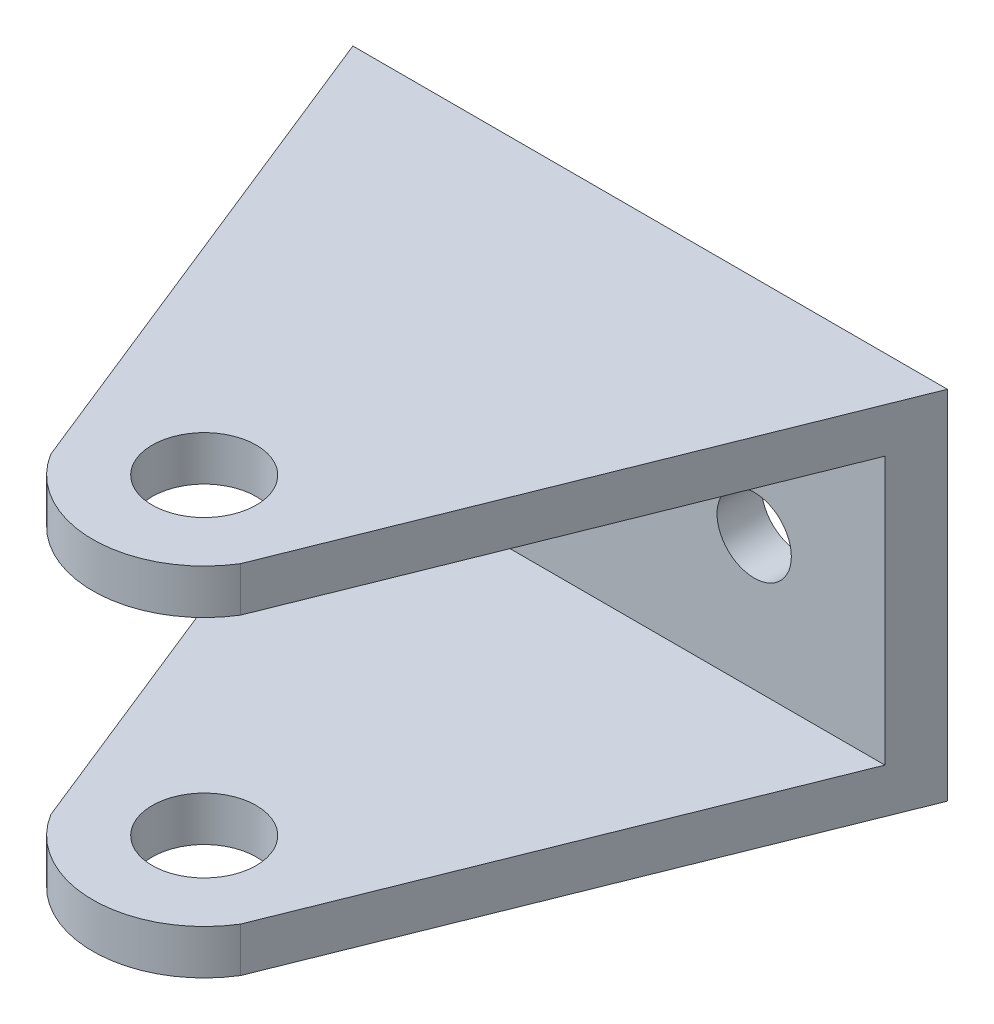
ISO-10303-21;
HEADER;
FILE_DESCRIPTION(('STEP AP214'),'2;1');
FILE_NAME('part.step','',(''),(''),'','','');
FILE_SCHEMA(('AUTOMOTIVE_DESIGN { 1 0 10303 214 1 1 1 1 }'));
ENDSEC;
DATA;
#1=APPLICATION_CONTEXT('core data for automotive mechanical design processes');
#2=APPLICATION_PROTOCOL_DEFINITION('international standard','automotive_design',2000,#1);
#3=PRODUCT_CONTEXT('',#1,'mechanical');
#4=PRODUCT('Part','Part','',(#3));
#5=PRODUCT_RELATED_PRODUCT_CATEGORY('part','',(#4));
#6=PRODUCT_DEFINITION_FORMATION('','',#4);
#7=PRODUCT_DEFINITION_CONTEXT('part definition',#1,'design');
#8=PRODUCT_DEFINITION('design','',#6,#7);
#9=PRODUCT_DEFINITION_SHAPE('','',#8);
#10=(LENGTH_UNIT() NAMED_UNIT(*) SI_UNIT(.MILLI.,.METRE.));
#11=(NAMED_UNIT(*) PLANE_ANGLE_UNIT() SI_UNIT($,.RADIAN.));
#12=(NAMED_UNIT(*) SI_UNIT($,.STERADIAN.) SOLID_ANGLE_UNIT());
#13=UNCERTAINTY_MEASURE_WITH_UNIT(LENGTH_MEASURE(1.E-05),#10,'distance_accuracy_value','');
#14=(GEOMETRIC_REPRESENTATION_CONTEXT(3) GLOBAL_UNCERTAINTY_ASSIGNED_CONTEXT((#13)) GLOBAL_UNIT_ASSIGNED_CONTEXT((#10,
#11,#12)) REPRESENTATION_CONTEXT('',''));
#15=CARTESIAN_POINT('',(0.,0.,0.));
#16=DIRECTION('',(0.,0.,1.));
#17=DIRECTION('',(1.,0.,0.));
#18=AXIS2_PLACEMENT_3D('',#15,#16,#17);
#19=CARTESIAN_POINT('',(0.,0.,3.));
#20=DIRECTION('',(0.,0.,1.));
#21=DIRECTION('',(1.,0.,0.));
#22=AXIS2_PLACEMENT_3D('',#19,#20,#21);
#23=PLANE('',#22);
#24=DIRECTION('',(0.,-1.,0.));
#25=VECTOR('',#24,1.);
#26=CARTESIAN_POINT('',(9.02360991477978,0.,3.));
#27=LINE('',#26,#25);
#28=CARTESIAN_POINT('',(9.02360991477978,13.3946482220998,3.));
#29=VERTEX_POINT('',#28);
#30=CARTESIAN_POINT('',(9.02360991477978,-4.60535177790018,3.));
#31=VERTEX_POINT('',#30);
#32=EDGE_CURVE('E166',#29,#31,#27,.T.);
#33=ORIENTED_EDGE('',*,*,#32,.F.);
#34=DIRECTION('',(1.,0.,0.));
#35=VECTOR('',#34,1.);
#36=CARTESIAN_POINT('',(-29.7726811713333,13.3946482220998,3.));
#37=LINE('',#36,#35);
#38=CARTESIAN_POINT('',(-28.5689722574463,13.3946482220998,3.));
#39=VERTEX_POINT('',#38);
#40=EDGE_CURVE('E178',#39,#29,#37,.T.);
#41=ORIENTED_EDGE('',*,*,#40,.F.);
#42=DIRECTION('',(0.,1.,0.));
#43=VECTOR('',#42,1.);
#44=CARTESIAN_POINT('',(-28.5689722574463,0.,3.));
#45=LINE('',#44,#43);
#46=CARTESIAN_POINT('',(-28.5689722574463,-4.60535177790018,3.));
#47=VERTEX_POINT('',#46);
#48=EDGE_CURVE('E51',#47,#39,#45,.T.);
#49=ORIENTED_EDGE('',*,*,#48,.F.);
#50=DIRECTION('',(-1.,0.,0.));
#51=VECTOR('',#50,1.);
#52=CARTESIAN_POINT('',(-29.7726811713333,-4.60535177790018,3.));
#53=LINE('',#52,#51);
#54=EDGE_CURVE('E180',#31,#47,#53,.T.);
#55=ORIENTED_EDGE('',*,*,#54,.F.);
#56=EDGE_LOOP('',(#33,#41,#49,#55));
#57=FACE_BOUND('',#56,.T.);
#58=CARTESIAN_POINT('',(-19.7726811713333,4.39464822209982,3.));
#59=DIRECTION('',(0.,0.,1.));
#60=DIRECTION('',(1.,0.,0.));
#61=AXIS2_PLACEMENT_3D('',#58,#59,#60);
#62=CIRCLE('',#61,2.5);
#63=CARTESIAN_POINT('',(-17.2726811713333,4.39464822209982,3.));
#64=VERTEX_POINT('',#63);
#65=EDGE_CURVE('E190',#64,#64,#62,.T.);
#66=ORIENTED_EDGE('',*,*,#65,.F.);
#67=EDGE_LOOP('',(#66));
#68=FACE_BOUND('',#67,.T.);
#69=CARTESIAN_POINT('',(0.227318828666726,4.39464822209982,3.));
#70=DIRECTION('',(0.,0.,1.));
#71=DIRECTION('',(1.,0.,0.));
#72=AXIS2_PLACEMENT_3D('',#69,#70,#71);
#73=CIRCLE('',#72,2.5);
#74=CARTESIAN_POINT('',(2.72731882866673,4.39464822209982,3.));
#75=VERTEX_POINT('',#74);
#76=EDGE_CURVE('E184',#75,#75,#73,.T.);
#77=ORIENTED_EDGE('',*,*,#76,.F.);
#78=EDGE_LOOP('',(#77));
#79=FACE_BOUND('',#78,.T.);
#80=ADVANCED_FACE('F35',(#57,#68,#79),#23,.T.);
#81=CARTESIAN_POINT('',(0.,0.,0.));
#82=DIRECTION('',(0.,0.,1.));
#83=DIRECTION('',(1.,0.,0.));
#84=AXIS2_PLACEMENT_3D('',#81,#82,#83);
#85=PLANE('',#84);
#86=DIRECTION('',(-1.,0.,0.));
#87=VECTOR('',#86,1.);
#88=CARTESIAN_POINT('',(-29.7726811713333,16.3946482220998,0.));
#89=LINE('',#88,#87);
#90=CARTESIAN_POINT('',(10.2273188286667,16.3946482220998,0.));
#91=VERTEX_POINT('',#90);
#92=CARTESIAN_POINT('',(-29.7726811713333,16.3946482220998,0.));
#93=VERTEX_POINT('',#92);
#94=EDGE_CURVE('E114',#91,#93,#89,.T.);
#95=ORIENTED_EDGE('',*,*,#94,.F.);
#96=DIRECTION('',(0.,1.,0.));
#97=VECTOR('',#96,1.);
#98=CARTESIAN_POINT('',(10.2273188286667,-7.60535177790018,0.));
#99=LINE('',#98,#97);
#100=CARTESIAN_POINT('',(10.2273188286667,-7.60535177790018,0.));
#101=VERTEX_POINT('',#100);
#102=EDGE_CURVE('E125',#101,#91,#99,.T.);
#103=ORIENTED_EDGE('',*,*,#102,.F.);
#104=DIRECTION('',(1.,0.,0.));
#105=VECTOR('',#104,1.);
#106=CARTESIAN_POINT('',(0.227318828666723,-7.60535177790018,0.));
#107=LINE('',#106,#105);
#108=CARTESIAN_POINT('',(-29.7726811713333,-7.60535177790018,0.));
#109=VERTEX_POINT('',#108);
#110=EDGE_CURVE('E113',#109,#101,#107,.T.);
#111=ORIENTED_EDGE('',*,*,#110,.F.);
#112=DIRECTION('',(0.,-1.,0.));
#113=VECTOR('',#112,1.);
#114=CARTESIAN_POINT('',(-29.7726811713333,16.3946482220998,0.));
#115=LINE('',#114,#113);
#116=EDGE_CURVE('E100',#93,#109,#115,.T.);
#117=ORIENTED_EDGE('',*,*,#116,.F.);
#118=EDGE_LOOP('',(#95,#103,#111,#117));
#119=FACE_BOUND('',#118,.T.);
#120=CARTESIAN_POINT('',(-19.7726811713333,4.39464822209982,0.));
#121=DIRECTION('',(0.,0.,1.));
#122=DIRECTION('',(1.,0.,0.));
#123=AXIS2_PLACEMENT_3D('',#120,#121,#122);
#124=CIRCLE('',#123,2.5);
#125=CARTESIAN_POINT('',(-17.2726811713333,4.39464822209982,0.));
#126=VERTEX_POINT('',#125);
#127=EDGE_CURVE('E187',#126,#126,#124,.T.);
#128=ORIENTED_EDGE('',*,*,#127,.T.);
#129=EDGE_LOOP('',(#128));
#130=FACE_BOUND('',#129,.T.);
#131=CARTESIAN_POINT('',(0.227318828666726,4.39464822209982,0.));
#132=DIRECTION('',(0.,0.,1.));
#133=DIRECTION('',(1.,0.,0.));
#134=AXIS2_PLACEMENT_3D('',#131,#132,#133);
#135=CIRCLE('',#134,2.5);
#136=CARTESIAN_POINT('',(2.72731882866673,4.39464822209982,0.));
#137=VERTEX_POINT('',#136);
#138=EDGE_CURVE('E183',#137,#137,#135,.T.);
#139=ORIENTED_EDGE('',*,*,#138,.T.);
#140=EDGE_LOOP('',(#139));
#141=FACE_BOUND('',#140,.T.);
#142=ADVANCED_FACE('F123',(#119,#130,#141),#85,.F.);
#143=CARTESIAN_POINT('',(-29.7726811713333,16.3946482220998,3.));
#144=DIRECTION('',(0.,-1.,0.));
#145=DIRECTION('',(0.,0.,-1.));
#146=AXIS2_PLACEMENT_3D('',#143,#144,#145);
#147=PLANE('',#146);
#148=CARTESIAN_POINT('',(-9.77268117133328,16.3946482220998,30.));
#149=DIRECTION('',(0.,-1.,0.));
#150=DIRECTION('',(0.,0.,-1.));
#151=AXIS2_PLACEMENT_3D('',#148,#149,#150);
#152=CIRCLE('',#151,3.5);
#153=CARTESIAN_POINT('',(-9.77268117133328,16.3946482220998,26.5));
#154=VERTEX_POINT('',#153);
#155=EDGE_CURVE('E175',#154,#154,#152,.T.);
#156=ORIENTED_EDGE('',*,*,#155,.T.);
#157=EDGE_LOOP('',(#156));
#158=FACE_BOUND('',#157,.T.);
#159=CARTESIAN_POINT('',(-9.77268117133328,16.3946482220998,30.));
#160=DIRECTION('',(0.,-1.,0.));
#161=DIRECTION('',(0.,0.,-1.));
#162=AXIS2_PLACEMENT_3D('',#159,#160,#161);
#163=CIRCLE('',#162,7.5);
#164=CARTESIAN_POINT('',(-16.155307847501,16.3946482220998,33.9385373824139));
#165=VERTEX_POINT('',#164);
#166=CARTESIAN_POINT('',(-3.39005449516551,16.3946482220998,33.9385373824139));
#167=VERTEX_POINT('',#166);
#168=EDGE_CURVE('E164',#165,#167,#163,.F.);
#169=ORIENTED_EDGE('',*,*,#168,.T.);
#170=DIRECTION('',(0.372379595116621,0.,-0.928080512208279));
#171=VECTOR('',#170,1.);
#172=CARTESIAN_POINT('',(3.64386157818276,16.3946482220998,16.4079301262921));
#173=LINE('',#172,#171);
#174=EDGE_CURVE('E148',#167,#91,#173,.T.);
#175=ORIENTED_EDGE('',*,*,#174,.T.);
#176=ORIENTED_EDGE('',*,*,#94,.T.);
#177=DIRECTION('',(0.372379595116621,0.,0.928080512208279));
#178=VECTOR('',#177,1.);
#179=CARTESIAN_POINT('',(-28.735886435218,16.3946482220998,2.58400031142234));
#180=LINE('',#179,#178);
#181=EDGE_CURVE('E108',#93,#165,#180,.T.);
#182=ORIENTED_EDGE('',*,*,#181,.T.);
#183=EDGE_LOOP('',(#169,#175,#176,#182));
#184=FACE_BOUND('',#183,.T.);
#185=ADVANCED_FACE('F37',(#158,#184),#147,.F.);
#186=CARTESIAN_POINT('',(0.227318828666723,-7.60535177790018,3.));
#187=DIRECTION('',(0.,1.,0.));
#188=DIRECTION('',(0.,0.,1.));
#189=AXIS2_PLACEMENT_3D('',#186,#187,#188);
#190=PLANE('',#189);
#191=CARTESIAN_POINT('',(-9.77268117133328,-7.60535177790018,30.));
#192=DIRECTION('',(0.,-1.,0.));
#193=DIRECTION('',(0.,0.,-1.));
#194=AXIS2_PLACEMENT_3D('',#191,#192,#193);
#195=CIRCLE('',#194,3.5);
#196=CARTESIAN_POINT('',(-9.77268117133328,-7.60535177790018,26.5));
#197=VERTEX_POINT('',#196);
#198=EDGE_CURVE('E121',#197,#197,#195,.T.);
#199=ORIENTED_EDGE('',*,*,#198,.F.);
#200=EDGE_LOOP('',(#199));
#201=FACE_BOUND('',#200,.T.);
#202=ORIENTED_EDGE('',*,*,#110,.T.);
#203=DIRECTION('',(0.372379595116621,0.,-0.928080512208279));
#204=VECTOR('',#203,1.);
#205=CARTESIAN_POINT('',(10.2273188286667,-7.60535177790018,0.));
#206=LINE('',#205,#204);
#207=CARTESIAN_POINT('',(-3.39005449516551,-7.60535177790018,33.9385373824139));
#208=VERTEX_POINT('',#207);
#209=EDGE_CURVE('E59',#208,#101,#206,.T.);
#210=ORIENTED_EDGE('',*,*,#209,.F.);
#211=CARTESIAN_POINT('',(-9.77268117133328,-7.60535177790018,30.));
#212=DIRECTION('',(0.,1.,0.));
#213=DIRECTION('',(0.,0.,-1.));
#214=AXIS2_PLACEMENT_3D('',#211,#212,#213);
#215=CIRCLE('',#214,7.5);
#216=CARTESIAN_POINT('',(-16.155307847501,-7.60535177790018,33.9385373824139));
#217=VERTEX_POINT('',#216);
#218=EDGE_CURVE('E120',#217,#208,#215,.T.);
#219=ORIENTED_EDGE('',*,*,#218,.F.);
#220=DIRECTION('',(0.372379595116621,0.,0.928080512208279));
#221=VECTOR('',#220,1.);
#222=CARTESIAN_POINT('',(-29.7726811713333,-7.60535177790018,0.));
#223=LINE('',#222,#221);
#224=EDGE_CURVE('E104',#109,#217,#223,.T.);
#225=ORIENTED_EDGE('',*,*,#224,.F.);
#226=EDGE_LOOP('',(#202,#210,#219,#225));
#227=FACE_BOUND('',#226,.T.);
#228=ADVANCED_FACE('F117',(#201,#227),#190,.F.);
#229=CARTESIAN_POINT('',(-19.7726811713333,4.39464822209982,3.));
#230=DIRECTION('',(0.,0.,-1.));
#231=DIRECTION('',(-1.,0.,0.));
#232=AXIS2_PLACEMENT_3D('',#229,#230,#231);
#233=CYLINDRICAL_SURFACE('',#232,2.5);
#234=ORIENTED_EDGE('',*,*,#65,.T.);
#235=EDGE_LOOP('',(#234));
#236=FACE_BOUND('',#235,.T.);
#237=ORIENTED_EDGE('',*,*,#127,.F.);
#238=EDGE_LOOP('',(#237));
#239=FACE_BOUND('',#238,.T.);
#240=ADVANCED_FACE('F201',(#236,#239),#233,.F.);
#241=CARTESIAN_POINT('',(0.227318828666726,4.39464822209982,3.));
#242=DIRECTION('',(0.,0.,-1.));
#243=DIRECTION('',(-1.,0.,0.));
#244=AXIS2_PLACEMENT_3D('',#241,#242,#243);
#245=CYLINDRICAL_SURFACE('',#244,2.5);
#246=ORIENTED_EDGE('',*,*,#76,.T.);
#247=EDGE_LOOP('',(#246));
#248=FACE_BOUND('',#247,.T.);
#249=ORIENTED_EDGE('',*,*,#138,.F.);
#250=EDGE_LOOP('',(#249));
#251=FACE_BOUND('',#250,.T.);
#252=ADVANCED_FACE('F213',(#248,#251),#245,.F.);
#253=CARTESIAN_POINT('',(-29.7726811713333,-4.60535177790018,43.));
#254=DIRECTION('',(0.,-1.,0.));
#255=DIRECTION('',(0.,0.,-1.));
#256=AXIS2_PLACEMENT_3D('',#253,#254,#255);
#257=PLANE('',#256);
#258=CARTESIAN_POINT('',(-9.77268117133328,-4.60535177790018,30.));
#259=DIRECTION('',(0.,-1.,0.));
#260=DIRECTION('',(0.,0.,-1.));
#261=AXIS2_PLACEMENT_3D('',#258,#259,#260);
#262=CIRCLE('',#261,3.5);
#263=CARTESIAN_POINT('',(-9.77268117133328,-4.60535177790018,26.5));
#264=VERTEX_POINT('',#263);
#265=EDGE_CURVE('E172',#264,#264,#262,.T.);
#266=ORIENTED_EDGE('',*,*,#265,.T.);
#267=EDGE_LOOP('',(#266));
#268=FACE_BOUND('',#267,.T.);
#269=CARTESIAN_POINT('',(-9.77268117133328,-4.60535177790018,30.));
#270=DIRECTION('',(0.,-1.,0.));
#271=DIRECTION('',(0.,0.,-1.));
#272=AXIS2_PLACEMENT_3D('',#269,#270,#271);
#273=CIRCLE('',#272,7.5);
#274=CARTESIAN_POINT('',(-16.155307847501,-4.60535177790018,33.9385373824139));
#275=VERTEX_POINT('',#274);
#276=CARTESIAN_POINT('',(-3.39005449516551,-4.60535177790018,33.9385373824139));
#277=VERTEX_POINT('',#276);
#278=EDGE_CURVE('E161',#275,#277,#273,.F.);
#279=ORIENTED_EDGE('',*,*,#278,.T.);
#280=DIRECTION('',(0.372379595116621,0.,-0.928080512208279));
#281=VECTOR('',#280,1.);
#282=CARTESIAN_POINT('',(-10.180068236687,-4.60535177790018,50.8612676119234));
#283=LINE('',#282,#281);
#284=EDGE_CURVE('E168',#277,#31,#283,.T.);
#285=ORIENTED_EDGE('',*,*,#284,.T.);
#286=ORIENTED_EDGE('',*,*,#54,.T.);
#287=DIRECTION('',(0.372379595116621,0.,0.928080512208279));
#288=VECTOR('',#287,1.);
#289=CARTESIAN_POINT('',(-14.9119566203482,-4.60535177790018,37.0373377970536));
#290=LINE('',#289,#288);
#291=EDGE_CURVE('E151',#47,#275,#290,.T.);
#292=ORIENTED_EDGE('',*,*,#291,.T.);
#293=EDGE_LOOP('',(#279,#285,#286,#292));
#294=FACE_BOUND('',#293,.T.);
#295=ADVANCED_FACE('F217',(#268,#294),#257,.F.);
#296=CARTESIAN_POINT('',(-29.7726811713333,13.3946482220998,43.));
#297=DIRECTION('',(0.,1.,0.));
#298=DIRECTION('',(0.,0.,1.));
#299=AXIS2_PLACEMENT_3D('',#296,#297,#298);
#300=PLANE('',#299);
#301=CARTESIAN_POINT('',(-9.77268117133328,13.3946482220998,30.));
#302=DIRECTION('',(0.,1.,0.));
#303=DIRECTION('',(0.,0.,1.));
#304=AXIS2_PLACEMENT_3D('',#301,#302,#303);
#305=CIRCLE('',#304,3.5);
#306=CARTESIAN_POINT('',(-9.77268117133328,13.3946482220998,33.5));
#307=VERTEX_POINT('',#306);
#308=EDGE_CURVE('E39',#307,#307,#305,.T.);
#309=ORIENTED_EDGE('',*,*,#308,.T.);
#310=EDGE_LOOP('',(#309));
#311=FACE_BOUND('',#310,.T.);
#312=ORIENTED_EDGE('',*,*,#40,.T.);
#313=DIRECTION('',(-0.372379595116621,0.,0.928080512208279));
#314=VECTOR('',#313,1.);
#315=CARTESIAN_POINT('',(-10.180068236687,13.3946482220998,50.8612676119234));
#316=LINE('',#315,#314);
#317=CARTESIAN_POINT('',(-3.39005449516551,13.3946482220998,33.9385373824139));
#318=VERTEX_POINT('',#317);
#319=EDGE_CURVE('E11',#29,#318,#316,.T.);
#320=ORIENTED_EDGE('',*,*,#319,.T.);
#321=CARTESIAN_POINT('',(-9.77268117133328,13.3946482220998,30.));
#322=DIRECTION('',(0.,1.,0.));
#323=DIRECTION('',(0.,0.,1.));
#324=AXIS2_PLACEMENT_3D('',#321,#322,#323);
#325=CIRCLE('',#324,7.5);
#326=CARTESIAN_POINT('',(-16.155307847501,13.3946482220998,33.9385373824139));
#327=VERTEX_POINT('',#326);
#328=EDGE_CURVE('E44',#318,#327,#325,.F.);
#329=ORIENTED_EDGE('',*,*,#328,.T.);
#330=DIRECTION('',(-0.372379595116621,0.,-0.928080512208279));
#331=VECTOR('',#330,1.);
#332=CARTESIAN_POINT('',(-14.9119566203482,13.3946482220998,37.0373377970536));
#333=LINE('',#332,#331);
#334=EDGE_CURVE('E127',#327,#39,#333,.T.);
#335=ORIENTED_EDGE('',*,*,#334,.T.);
#336=EDGE_LOOP('',(#312,#320,#329,#335));
#337=FACE_BOUND('',#336,.T.);
#338=ADVANCED_FACE('F135',(#311,#337),#300,.F.);
#339=CARTESIAN_POINT('',(10.2273188286667,32.3946482220998,0.));
#340=DIRECTION('',(-0.928080512208279,0.,-0.372379595116621));
#341=DIRECTION('',(-0.372379595116621,0.,0.928080512208279));
#342=AXIS2_PLACEMENT_3D('',#339,#340,#341);
#343=PLANE('',#342);
#344=DIRECTION('',(0.,-1.,0.));
#345=VECTOR('',#344,1.);
#346=CARTESIAN_POINT('',(-3.39005449516551,32.3946482220998,33.9385373824139));
#347=LINE('',#346,#345);
#348=EDGE_CURVE('E142',#167,#318,#347,.T.);
#349=ORIENTED_EDGE('',*,*,#348,.T.);
#350=ORIENTED_EDGE('',*,*,#319,.F.);
#351=ORIENTED_EDGE('',*,*,#32,.T.);
#352=ORIENTED_EDGE('',*,*,#284,.F.);
#353=EDGE_CURVE('E149',#277,#208,#347,.T.);
#354=ORIENTED_EDGE('',*,*,#353,.T.);
#355=ORIENTED_EDGE('',*,*,#209,.T.);
#356=ORIENTED_EDGE('',*,*,#102,.T.);
#357=ORIENTED_EDGE('',*,*,#174,.F.);
#358=EDGE_LOOP('',(#349,#350,#351,#352,#354,#355,#356,#357));
#359=FACE_BOUND('',#358,.T.);
#360=ADVANCED_FACE('F145',(#359),#343,.F.);
#361=CARTESIAN_POINT('',(-9.77268117133328,32.3946482220998,30.));
#362=DIRECTION('',(0.,-1.,0.));
#363=DIRECTION('',(0.,0.,-1.));
#364=AXIS2_PLACEMENT_3D('',#361,#362,#363);
#365=CYLINDRICAL_SURFACE('',#364,7.5);
#366=DIRECTION('',(0.,-1.,0.));
#367=VECTOR('',#366,1.);
#368=CARTESIAN_POINT('',(-16.155307847501,32.3946482220998,33.9385373824139));
#369=LINE('',#368,#367);
#370=EDGE_CURVE('E144',#165,#327,#369,.T.);
#371=ORIENTED_EDGE('',*,*,#370,.T.);
#372=ORIENTED_EDGE('',*,*,#328,.F.);
#373=ORIENTED_EDGE('',*,*,#348,.F.);
#374=ORIENTED_EDGE('',*,*,#168,.F.);
#375=EDGE_LOOP('',(#371,#372,#373,#374));
#376=FACE_BOUND('',#375,.T.);
#377=ADVANCED_FACE('F141',(#376),#365,.T.);
#378=EDGE_CURVE('E156',#275,#217,#369,.T.);
#379=ORIENTED_EDGE('',*,*,#378,.T.);
#380=ORIENTED_EDGE('',*,*,#218,.T.);
#381=ORIENTED_EDGE('',*,*,#353,.F.);
#382=ORIENTED_EDGE('',*,*,#278,.F.);
#383=EDGE_LOOP('',(#379,#380,#381,#382));
#384=FACE_BOUND('',#383,.T.);
#385=ADVANCED_FACE('F228',(#384),#365,.T.);
#386=CARTESIAN_POINT('',(-29.7726811713333,32.3946482220998,0.));
#387=DIRECTION('',(0.928080512208279,0.,-0.372379595116621));
#388=DIRECTION('',(-0.372379595116621,0.,-0.928080512208279));
#389=AXIS2_PLACEMENT_3D('',#386,#387,#388);
#390=PLANE('',#389);
#391=ORIENTED_EDGE('',*,*,#116,.T.);
#392=ORIENTED_EDGE('',*,*,#224,.T.);
#393=ORIENTED_EDGE('',*,*,#378,.F.);
#394=ORIENTED_EDGE('',*,*,#291,.F.);
#395=ORIENTED_EDGE('',*,*,#48,.T.);
#396=ORIENTED_EDGE('',*,*,#334,.F.);
#397=ORIENTED_EDGE('',*,*,#370,.F.);
#398=ORIENTED_EDGE('',*,*,#181,.F.);
#399=EDGE_LOOP('',(#391,#392,#393,#394,#395,#396,#397,#398));
#400=FACE_BOUND('',#399,.T.);
#401=ADVANCED_FACE('F102',(#400),#390,.F.);
#402=CARTESIAN_POINT('',(-9.77268117133328,32.3946482220998,30.));
#403=DIRECTION('',(0.,-1.,0.));
#404=DIRECTION('',(0.,0.,-1.));
#405=AXIS2_PLACEMENT_3D('',#402,#403,#404);
#406=CYLINDRICAL_SURFACE('',#405,3.5);
#407=ORIENTED_EDGE('',*,*,#308,.F.);
#408=EDGE_LOOP('',(#407));
#409=FACE_BOUND('',#408,.T.);
#410=ORIENTED_EDGE('',*,*,#155,.F.);
#411=EDGE_LOOP('',(#410));
#412=FACE_BOUND('',#411,.T.);
#413=ADVANCED_FACE('F227',(#409,#412),#406,.F.);
#414=ORIENTED_EDGE('',*,*,#198,.T.);
#415=EDGE_LOOP('',(#414));
#416=FACE_BOUND('',#415,.T.);
#417=ORIENTED_EDGE('',*,*,#265,.F.);
#418=EDGE_LOOP('',(#417));
#419=FACE_BOUND('',#418,.T.);
#420=ADVANCED_FACE('F234',(#416,#419),#406,.F.);
#421=CLOSED_SHELL('',(#80,#142,#185,#228,#240,#252,#295,#338,#360,#377,#385,#401,#413,#420));
#422=MANIFOLD_SOLID_BREP('B2',#421);
#423=ADVANCED_BREP_SHAPE_REPRESENTATION('',(#18,#422),#14);
#424=SHAPE_DEFINITION_REPRESENTATION(#9,#423);
ENDSEC;
END-ISO-10303-21;
